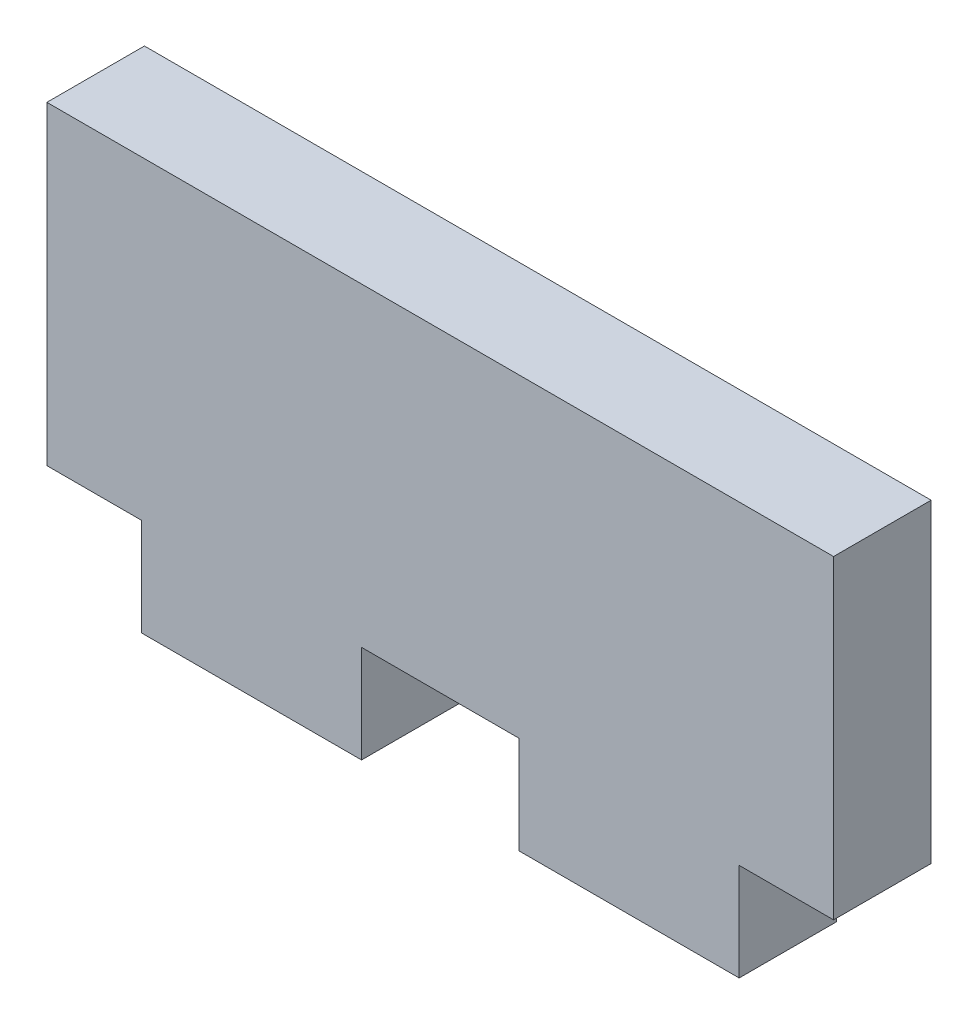
ISO-10303-21;
HEADER;
FILE_DESCRIPTION(('STEP AP214'),'2;1');
FILE_NAME('part.step','',(''),(''),'','','');
FILE_SCHEMA(('AUTOMOTIVE_DESIGN { 1 0 10303 214 1 1 1 1 }'));
ENDSEC;
DATA;
#1=APPLICATION_CONTEXT('core data for automotive mechanical design processes');
#2=APPLICATION_PROTOCOL_DEFINITION('international standard','automotive_design',2000,#1);
#3=PRODUCT_CONTEXT('',#1,'mechanical');
#4=PRODUCT('Part','Part','',(#3));
#5=PRODUCT_RELATED_PRODUCT_CATEGORY('part','',(#4));
#6=PRODUCT_DEFINITION_FORMATION('','',#4);
#7=PRODUCT_DEFINITION_CONTEXT('part definition',#1,'design');
#8=PRODUCT_DEFINITION('design','',#6,#7);
#9=PRODUCT_DEFINITION_SHAPE('','',#8);
#10=(LENGTH_UNIT() NAMED_UNIT(*) SI_UNIT(.MILLI.,.METRE.));
#11=(NAMED_UNIT(*) PLANE_ANGLE_UNIT() SI_UNIT($,.RADIAN.));
#12=(NAMED_UNIT(*) SI_UNIT($,.STERADIAN.) SOLID_ANGLE_UNIT());
#13=UNCERTAINTY_MEASURE_WITH_UNIT(LENGTH_MEASURE(1.E-05),#10,'distance_accuracy_value','');
#14=(GEOMETRIC_REPRESENTATION_CONTEXT(3) GLOBAL_UNCERTAINTY_ASSIGNED_CONTEXT((#13)) GLOBAL_UNIT_ASSIGNED_CONTEXT((#10,
#11,#12)) REPRESENTATION_CONTEXT('',''));
#15=CARTESIAN_POINT('',(0.,0.,0.));
#16=DIRECTION('',(0.,0.,1.));
#17=DIRECTION('',(1.,0.,0.));
#18=AXIS2_PLACEMENT_3D('',#15,#16,#17);
#19=CARTESIAN_POINT('',(0.,-5.,3.1));
#20=DIRECTION('',(0.,1.,0.));
#21=DIRECTION('',(0.,0.,1.));
#22=AXIS2_PLACEMENT_3D('',#19,#20,#21);
#23=PLANE('',#22);
#24=DIRECTION('',(1.,0.,0.));
#25=VECTOR('',#24,1.);
#26=CARTESIAN_POINT('',(0.,-5.,0.));
#27=LINE('',#26,#25);
#28=CARTESIAN_POINT('',(-12.5,-5.,0.));
#29=VERTEX_POINT('',#28);
#30=CARTESIAN_POINT('',(-9.5,-5.,0.));
#31=VERTEX_POINT('',#30);
#32=EDGE_CURVE('E158',#29,#31,#27,.T.);
#33=ORIENTED_EDGE('',*,*,#32,.T.);
#34=DIRECTION('',(0.,0.,-1.));
#35=VECTOR('',#34,1.);
#36=CARTESIAN_POINT('',(-9.5,-5.,3.1));
#37=LINE('',#36,#35);
#38=CARTESIAN_POINT('',(-9.5,-5.,3.1));
#39=VERTEX_POINT('',#38);
#40=EDGE_CURVE('E11',#39,#31,#37,.T.);
#41=ORIENTED_EDGE('',*,*,#40,.F.);
#42=DIRECTION('',(1.,0.,0.));
#43=VECTOR('',#42,1.);
#44=CARTESIAN_POINT('',(0.,-5.,3.1));
#45=LINE('',#44,#43);
#46=CARTESIAN_POINT('',(-12.5,-5.,3.1));
#47=VERTEX_POINT('',#46);
#48=EDGE_CURVE('E185',#47,#39,#45,.T.);
#49=ORIENTED_EDGE('',*,*,#48,.F.);
#50=DIRECTION('',(0.,0.,-1.));
#51=VECTOR('',#50,1.);
#52=CARTESIAN_POINT('',(-12.5,-5.,3.1));
#53=LINE('',#52,#51);
#54=EDGE_CURVE('E52',#47,#29,#53,.T.);
#55=ORIENTED_EDGE('',*,*,#54,.T.);
#56=EDGE_LOOP('',(#33,#41,#49,#55));
#57=FACE_BOUND('',#56,.T.);
#58=ADVANCED_FACE('F35',(#57),#23,.F.);
#59=CARTESIAN_POINT('',(-9.5,0.,3.1));
#60=DIRECTION('',(1.,0.,0.));
#61=DIRECTION('',(0.,0.,-1.));
#62=AXIS2_PLACEMENT_3D('',#59,#60,#61);
#63=PLANE('',#62);
#64=DIRECTION('',(0.,-1.,0.));
#65=VECTOR('',#64,1.);
#66=CARTESIAN_POINT('',(-9.5,0.,0.));
#67=LINE('',#66,#65);
#68=CARTESIAN_POINT('',(-9.5,-8.1,0.));
#69=VERTEX_POINT('',#68);
#70=EDGE_CURVE('E160',#31,#69,#67,.T.);
#71=ORIENTED_EDGE('',*,*,#70,.T.);
#72=DIRECTION('',(0.,0.,-1.));
#73=VECTOR('',#72,1.);
#74=CARTESIAN_POINT('',(-9.5,-8.1,3.1));
#75=LINE('',#74,#73);
#76=CARTESIAN_POINT('',(-9.5,-8.1,3.1));
#77=VERTEX_POINT('',#76);
#78=EDGE_CURVE('E44',#77,#69,#75,.T.);
#79=ORIENTED_EDGE('',*,*,#78,.F.);
#80=DIRECTION('',(0.,-1.,0.));
#81=VECTOR('',#80,1.);
#82=CARTESIAN_POINT('',(-9.5,0.,3.1));
#83=LINE('',#82,#81);
#84=EDGE_CURVE('E102',#39,#77,#83,.T.);
#85=ORIENTED_EDGE('',*,*,#84,.F.);
#86=ORIENTED_EDGE('',*,*,#40,.T.);
#87=EDGE_LOOP('',(#71,#79,#85,#86));
#88=FACE_BOUND('',#87,.T.);
#89=ADVANCED_FACE('F37',(#88),#63,.F.);
#90=CARTESIAN_POINT('',(0.,-8.1,3.1));
#91=DIRECTION('',(0.,1.,0.));
#92=DIRECTION('',(0.,0.,1.));
#93=AXIS2_PLACEMENT_3D('',#90,#91,#92);
#94=PLANE('',#93);
#95=DIRECTION('',(1.,0.,0.));
#96=VECTOR('',#95,1.);
#97=CARTESIAN_POINT('',(0.,-8.1,0.));
#98=LINE('',#97,#96);
#99=CARTESIAN_POINT('',(-2.5,-8.1,0.));
#100=VERTEX_POINT('',#99);
#101=EDGE_CURVE('E164',#69,#100,#98,.T.);
#102=ORIENTED_EDGE('',*,*,#101,.T.);
#103=DIRECTION('',(0.,0.,-1.));
#104=VECTOR('',#103,1.);
#105=CARTESIAN_POINT('',(-2.5,-8.1,3.1));
#106=LINE('',#105,#104);
#107=CARTESIAN_POINT('',(-2.5,-8.1,3.1));
#108=VERTEX_POINT('',#107);
#109=EDGE_CURVE('E200',#108,#100,#106,.T.);
#110=ORIENTED_EDGE('',*,*,#109,.F.);
#111=DIRECTION('',(1.,0.,0.));
#112=VECTOR('',#111,1.);
#113=CARTESIAN_POINT('',(0.,-8.1,3.1));
#114=LINE('',#113,#112);
#115=EDGE_CURVE('E207',#77,#108,#114,.T.);
#116=ORIENTED_EDGE('',*,*,#115,.F.);
#117=ORIENTED_EDGE('',*,*,#78,.T.);
#118=EDGE_LOOP('',(#102,#110,#116,#117));
#119=FACE_BOUND('',#118,.T.);
#120=ADVANCED_FACE('F205',(#119),#94,.F.);
#121=CARTESIAN_POINT('',(-2.5,0.,3.1));
#122=DIRECTION('',(1.,0.,0.));
#123=DIRECTION('',(0.,0.,-1.));
#124=AXIS2_PLACEMENT_3D('',#121,#122,#123);
#125=PLANE('',#124);
#126=DIRECTION('',(0.,-1.,0.));
#127=VECTOR('',#126,1.);
#128=CARTESIAN_POINT('',(-2.5,0.,0.));
#129=LINE('',#128,#127);
#130=CARTESIAN_POINT('',(-2.5,-5.,0.));
#131=VERTEX_POINT('',#130);
#132=EDGE_CURVE('E167',#131,#100,#129,.T.);
#133=ORIENTED_EDGE('',*,*,#132,.F.);
#134=DIRECTION('',(0.,0.,-1.));
#135=VECTOR('',#134,1.);
#136=CARTESIAN_POINT('',(-2.5,-5.,3.1));
#137=LINE('',#136,#135);
#138=CARTESIAN_POINT('',(-2.5,-5.,3.1));
#139=VERTEX_POINT('',#138);
#140=EDGE_CURVE('E198',#139,#131,#137,.T.);
#141=ORIENTED_EDGE('',*,*,#140,.F.);
#142=DIRECTION('',(0.,-1.,0.));
#143=VECTOR('',#142,1.);
#144=CARTESIAN_POINT('',(-2.5,0.,3.1));
#145=LINE('',#144,#143);
#146=EDGE_CURVE('E218',#139,#108,#145,.T.);
#147=ORIENTED_EDGE('',*,*,#146,.T.);
#148=ORIENTED_EDGE('',*,*,#109,.T.);
#149=EDGE_LOOP('',(#133,#141,#147,#148));
#150=FACE_BOUND('',#149,.T.);
#151=ADVANCED_FACE('F214',(#150),#125,.T.);
#152=CARTESIAN_POINT('',(2.5,-5.,0.));
#153=VERTEX_POINT('',#152);
#154=EDGE_CURVE('E162',#131,#153,#27,.T.);
#155=ORIENTED_EDGE('',*,*,#154,.T.);
#156=DIRECTION('',(0.,0.,-1.));
#157=VECTOR('',#156,1.);
#158=CARTESIAN_POINT('',(2.5,-5.,3.1));
#159=LINE('',#158,#157);
#160=CARTESIAN_POINT('',(2.5,-5.,3.1));
#161=VERTEX_POINT('',#160);
#162=EDGE_CURVE('E195',#161,#153,#159,.T.);
#163=ORIENTED_EDGE('',*,*,#162,.F.);
#164=EDGE_CURVE('E219',#139,#161,#45,.T.);
#165=ORIENTED_EDGE('',*,*,#164,.F.);
#166=ORIENTED_EDGE('',*,*,#140,.T.);
#167=EDGE_LOOP('',(#155,#163,#165,#166));
#168=FACE_BOUND('',#167,.T.);
#169=ADVANCED_FACE('F239',(#168),#23,.F.);
#170=CARTESIAN_POINT('',(2.5,0.,3.1));
#171=DIRECTION('',(1.,0.,0.));
#172=DIRECTION('',(0.,1.,0.));
#173=AXIS2_PLACEMENT_3D('',#170,#171,#172);
#174=PLANE('',#173);
#175=DIRECTION('',(0.,-1.,0.));
#176=VECTOR('',#175,1.);
#177=CARTESIAN_POINT('',(2.5,0.,0.));
#178=LINE('',#177,#176);
#179=CARTESIAN_POINT('',(2.5,-8.1,0.));
#180=VERTEX_POINT('',#179);
#181=EDGE_CURVE('E170',#153,#180,#178,.T.);
#182=ORIENTED_EDGE('',*,*,#181,.T.);
#183=DIRECTION('',(0.,0.,-1.));
#184=VECTOR('',#183,1.);
#185=CARTESIAN_POINT('',(2.5,-8.1,3.1));
#186=LINE('',#185,#184);
#187=CARTESIAN_POINT('',(2.5,-8.1,3.1));
#188=VERTEX_POINT('',#187);
#189=EDGE_CURVE('E193',#188,#180,#186,.T.);
#190=ORIENTED_EDGE('',*,*,#189,.F.);
#191=DIRECTION('',(0.,-1.,0.));
#192=VECTOR('',#191,1.);
#193=CARTESIAN_POINT('',(2.5,0.,3.1));
#194=LINE('',#193,#192);
#195=EDGE_CURVE('E221',#161,#188,#194,.T.);
#196=ORIENTED_EDGE('',*,*,#195,.F.);
#197=ORIENTED_EDGE('',*,*,#162,.T.);
#198=EDGE_LOOP('',(#182,#190,#196,#197));
#199=FACE_BOUND('',#198,.T.);
#200=ADVANCED_FACE('F246',(#199),#174,.F.);
#201=CARTESIAN_POINT('',(0.,-8.1,3.1));
#202=DIRECTION('',(0.,-1.,0.));
#203=DIRECTION('',(1.,0.,0.));
#204=AXIS2_PLACEMENT_3D('',#201,#202,#203);
#205=PLANE('',#204);
#206=DIRECTION('',(-1.,0.,0.));
#207=VECTOR('',#206,1.);
#208=CARTESIAN_POINT('',(0.,-8.1,0.));
#209=LINE('',#208,#207);
#210=CARTESIAN_POINT('',(9.5,-8.1,0.));
#211=VERTEX_POINT('',#210);
#212=EDGE_CURVE('E173',#211,#180,#209,.T.);
#213=ORIENTED_EDGE('',*,*,#212,.F.);
#214=DIRECTION('',(0.,0.,-1.));
#215=VECTOR('',#214,1.);
#216=CARTESIAN_POINT('',(9.5,-8.1,3.1));
#217=LINE('',#216,#215);
#218=CARTESIAN_POINT('',(9.5,-8.1,3.1));
#219=VERTEX_POINT('',#218);
#220=EDGE_CURVE('E191',#219,#211,#217,.T.);
#221=ORIENTED_EDGE('',*,*,#220,.F.);
#222=DIRECTION('',(-1.,0.,0.));
#223=VECTOR('',#222,1.);
#224=CARTESIAN_POINT('',(0.,-8.1,3.1));
#225=LINE('',#224,#223);
#226=EDGE_CURVE('E227',#219,#188,#225,.T.);
#227=ORIENTED_EDGE('',*,*,#226,.T.);
#228=ORIENTED_EDGE('',*,*,#189,.T.);
#229=EDGE_LOOP('',(#213,#221,#227,#228));
#230=FACE_BOUND('',#229,.T.);
#231=ADVANCED_FACE('F255',(#230),#205,.T.);
#232=CARTESIAN_POINT('',(9.5,0.,3.1));
#233=DIRECTION('',(1.,0.,0.));
#234=DIRECTION('',(0.,0.,-1.));
#235=AXIS2_PLACEMENT_3D('',#232,#233,#234);
#236=PLANE('',#235);
#237=DIRECTION('',(0.,-1.,0.));
#238=VECTOR('',#237,1.);
#239=CARTESIAN_POINT('',(9.5,0.,0.));
#240=LINE('',#239,#238);
#241=CARTESIAN_POINT('',(9.5,-5.,0.));
#242=VERTEX_POINT('',#241);
#243=EDGE_CURVE('E176',#242,#211,#240,.T.);
#244=ORIENTED_EDGE('',*,*,#243,.F.);
#245=DIRECTION('',(0.,0.,-1.));
#246=VECTOR('',#245,1.);
#247=CARTESIAN_POINT('',(9.5,-5.,3.1));
#248=LINE('',#247,#246);
#249=CARTESIAN_POINT('',(9.5,-5.,3.1));
#250=VERTEX_POINT('',#249);
#251=EDGE_CURVE('E189',#250,#242,#248,.T.);
#252=ORIENTED_EDGE('',*,*,#251,.F.);
#253=DIRECTION('',(0.,-1.,0.));
#254=VECTOR('',#253,1.);
#255=CARTESIAN_POINT('',(9.5,0.,3.1));
#256=LINE('',#255,#254);
#257=EDGE_CURVE('E229',#250,#219,#256,.T.);
#258=ORIENTED_EDGE('',*,*,#257,.T.);
#259=ORIENTED_EDGE('',*,*,#220,.T.);
#260=EDGE_LOOP('',(#244,#252,#258,#259));
#261=FACE_BOUND('',#260,.T.);
#262=ADVANCED_FACE('F249',(#261),#236,.T.);
#263=CARTESIAN_POINT('',(12.5,-5.,0.));
#264=VERTEX_POINT('',#263);
#265=EDGE_CURVE('E161',#242,#264,#27,.T.);
#266=ORIENTED_EDGE('',*,*,#265,.T.);
#267=DIRECTION('',(0.,0.,-1.));
#268=VECTOR('',#267,1.);
#269=CARTESIAN_POINT('',(12.5,-5.,3.1));
#270=LINE('',#269,#268);
#271=CARTESIAN_POINT('',(12.5,-5.,3.1));
#272=VERTEX_POINT('',#271);
#273=EDGE_CURVE('E150',#272,#264,#270,.T.);
#274=ORIENTED_EDGE('',*,*,#273,.F.);
#275=EDGE_CURVE('E138',#250,#272,#45,.T.);
#276=ORIENTED_EDGE('',*,*,#275,.F.);
#277=ORIENTED_EDGE('',*,*,#251,.T.);
#278=EDGE_LOOP('',(#266,#274,#276,#277));
#279=FACE_BOUND('',#278,.T.);
#280=ADVANCED_FACE('F240',(#279),#23,.F.);
#281=CARTESIAN_POINT('',(12.5,0.,3.1));
#282=DIRECTION('',(-1.,0.,0.));
#283=DIRECTION('',(0.,0.,1.));
#284=AXIS2_PLACEMENT_3D('',#281,#282,#283);
#285=PLANE('',#284);
#286=DIRECTION('',(0.,1.,0.));
#287=VECTOR('',#286,1.);
#288=CARTESIAN_POINT('',(12.5,0.,0.));
#289=LINE('',#288,#287);
#290=CARTESIAN_POINT('',(12.5,5.,0.));
#291=VERTEX_POINT('',#290);
#292=EDGE_CURVE('E147',#264,#291,#289,.T.);
#293=ORIENTED_EDGE('',*,*,#292,.T.);
#294=DIRECTION('',(0.,0.,-1.));
#295=VECTOR('',#294,1.);
#296=CARTESIAN_POINT('',(12.5,5.,3.1));
#297=LINE('',#296,#295);
#298=CARTESIAN_POINT('',(12.5,5.,3.1));
#299=VERTEX_POINT('',#298);
#300=EDGE_CURVE('E144',#299,#291,#297,.T.);
#301=ORIENTED_EDGE('',*,*,#300,.F.);
#302=DIRECTION('',(0.,1.,0.));
#303=VECTOR('',#302,1.);
#304=CARTESIAN_POINT('',(12.5,0.,3.1));
#305=LINE('',#304,#303);
#306=EDGE_CURVE('E130',#272,#299,#305,.T.);
#307=ORIENTED_EDGE('',*,*,#306,.F.);
#308=ORIENTED_EDGE('',*,*,#273,.T.);
#309=EDGE_LOOP('',(#293,#301,#307,#308));
#310=FACE_BOUND('',#309,.T.);
#311=ADVANCED_FACE('F145',(#310),#285,.F.);
#312=CARTESIAN_POINT('',(0.,5.,3.1));
#313=DIRECTION('',(0.,1.,0.));
#314=DIRECTION('',(-1.,0.,0.));
#315=AXIS2_PLACEMENT_3D('',#312,#313,#314);
#316=PLANE('',#315);
#317=DIRECTION('',(1.,0.,0.));
#318=VECTOR('',#317,1.);
#319=CARTESIAN_POINT('',(0.,5.,0.));
#320=LINE('',#319,#318);
#321=CARTESIAN_POINT('',(-12.5,4.99999999999999,0.));
#322=VERTEX_POINT('',#321);
#323=EDGE_CURVE('E180',#322,#291,#320,.T.);
#324=ORIENTED_EDGE('',*,*,#323,.F.);
#325=DIRECTION('',(0.,0.,-1.));
#326=VECTOR('',#325,1.);
#327=CARTESIAN_POINT('',(-12.5,4.99999999999999,3.1));
#328=LINE('',#327,#326);
#329=CARTESIAN_POINT('',(-12.5,4.99999999999999,3.1));
#330=VERTEX_POINT('',#329);
#331=EDGE_CURVE('E90',#330,#322,#328,.T.);
#332=ORIENTED_EDGE('',*,*,#331,.F.);
#333=DIRECTION('',(1.,0.,0.));
#334=VECTOR('',#333,1.);
#335=CARTESIAN_POINT('',(0.,5.,3.1));
#336=LINE('',#335,#334);
#337=EDGE_CURVE('E135',#330,#299,#336,.T.);
#338=ORIENTED_EDGE('',*,*,#337,.T.);
#339=ORIENTED_EDGE('',*,*,#300,.T.);
#340=EDGE_LOOP('',(#324,#332,#338,#339));
#341=FACE_BOUND('',#340,.T.);
#342=ADVANCED_FACE('F152',(#341),#316,.T.);
#343=CARTESIAN_POINT('',(-12.5,0.,3.1));
#344=DIRECTION('',(-1.,0.,0.));
#345=DIRECTION('',(0.,0.,1.));
#346=AXIS2_PLACEMENT_3D('',#343,#344,#345);
#347=PLANE('',#346);
#348=DIRECTION('',(0.,1.,0.));
#349=VECTOR('',#348,1.);
#350=CARTESIAN_POINT('',(-12.5,0.,0.));
#351=LINE('',#350,#349);
#352=EDGE_CURVE('E182',#29,#322,#351,.T.);
#353=ORIENTED_EDGE('',*,*,#352,.F.);
#354=ORIENTED_EDGE('',*,*,#54,.F.);
#355=DIRECTION('',(0.,1.,0.));
#356=VECTOR('',#355,1.);
#357=CARTESIAN_POINT('',(-12.5,0.,3.1));
#358=LINE('',#357,#356);
#359=EDGE_CURVE('E153',#47,#330,#358,.T.);
#360=ORIENTED_EDGE('',*,*,#359,.T.);
#361=ORIENTED_EDGE('',*,*,#331,.T.);
#362=EDGE_LOOP('',(#353,#354,#360,#361));
#363=FACE_BOUND('',#362,.T.);
#364=ADVANCED_FACE('F258',(#363),#347,.T.);
#365=CARTESIAN_POINT('',(0.,0.,3.1));
#366=DIRECTION('',(0.,0.,1.));
#367=DIRECTION('',(1.,0.,0.));
#368=AXIS2_PLACEMENT_3D('',#365,#366,#367);
#369=PLANE('',#368);
#370=ORIENTED_EDGE('',*,*,#48,.T.);
#371=ORIENTED_EDGE('',*,*,#84,.T.);
#372=ORIENTED_EDGE('',*,*,#115,.T.);
#373=ORIENTED_EDGE('',*,*,#146,.F.);
#374=ORIENTED_EDGE('',*,*,#164,.T.);
#375=ORIENTED_EDGE('',*,*,#195,.T.);
#376=ORIENTED_EDGE('',*,*,#226,.F.);
#377=ORIENTED_EDGE('',*,*,#257,.F.);
#378=ORIENTED_EDGE('',*,*,#275,.T.);
#379=ORIENTED_EDGE('',*,*,#306,.T.);
#380=ORIENTED_EDGE('',*,*,#337,.F.);
#381=ORIENTED_EDGE('',*,*,#359,.F.);
#382=EDGE_LOOP('',(#370,#371,#372,#373,#374,#375,#376,#377,#378,#379,#380,#381));
#383=FACE_BOUND('',#382,.T.);
#384=ADVANCED_FACE('F132',(#383),#369,.T.);
#385=CARTESIAN_POINT('',(0.,0.,0.));
#386=DIRECTION('',(0.,0.,1.));
#387=DIRECTION('',(1.,0.,0.));
#388=AXIS2_PLACEMENT_3D('',#385,#386,#387);
#389=PLANE('',#388);
#390=ORIENTED_EDGE('',*,*,#32,.F.);
#391=ORIENTED_EDGE('',*,*,#352,.T.);
#392=ORIENTED_EDGE('',*,*,#323,.T.);
#393=ORIENTED_EDGE('',*,*,#292,.F.);
#394=ORIENTED_EDGE('',*,*,#265,.F.);
#395=ORIENTED_EDGE('',*,*,#243,.T.);
#396=ORIENTED_EDGE('',*,*,#212,.T.);
#397=ORIENTED_EDGE('',*,*,#181,.F.);
#398=ORIENTED_EDGE('',*,*,#154,.F.);
#399=ORIENTED_EDGE('',*,*,#132,.T.);
#400=ORIENTED_EDGE('',*,*,#101,.F.);
#401=ORIENTED_EDGE('',*,*,#70,.F.);
#402=EDGE_LOOP('',(#390,#391,#392,#393,#394,#395,#396,#397,#398,#399,#400,#401));
#403=FACE_BOUND('',#402,.T.);
#404=ADVANCED_FACE('F209',(#403),#389,.F.);
#405=CLOSED_SHELL('',(#58,#89,#120,#151,#169,#200,#231,#262,#280,#311,#342,#364,#384,#404));
#406=MANIFOLD_SOLID_BREP('B2',#405);
#407=ADVANCED_BREP_SHAPE_REPRESENTATION('',(#18,#406),#14);
#408=SHAPE_DEFINITION_REPRESENTATION(#9,#407);
ENDSEC;
END-ISO-10303-21;
